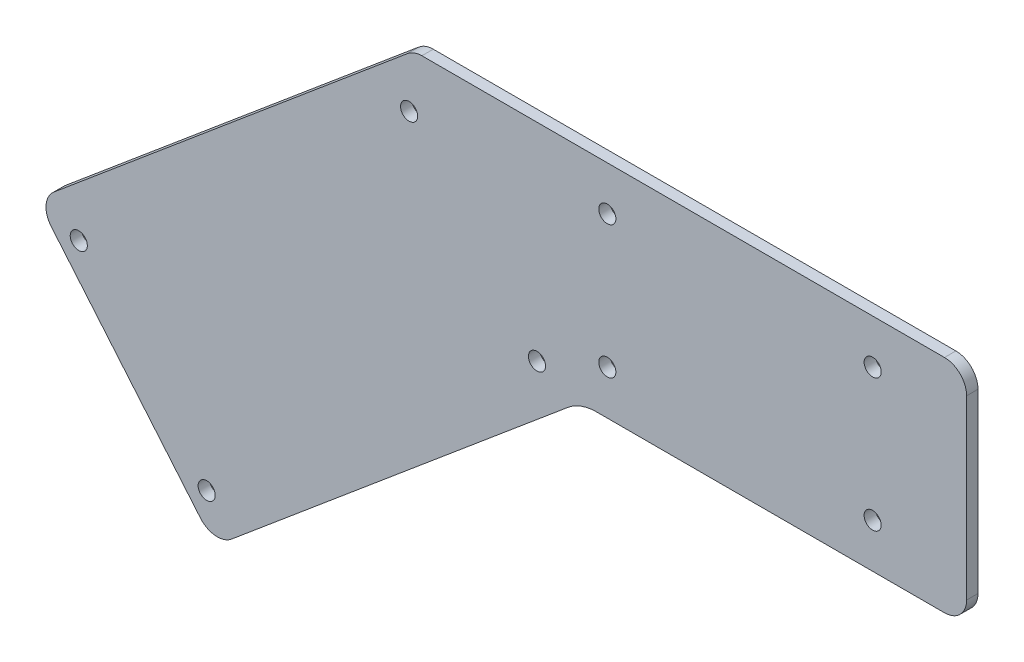
ISO-10303-21;
HEADER;
FILE_DESCRIPTION(('STEP AP214'),'2;1');
FILE_NAME('part.step','',(''),(''),'','','');
FILE_SCHEMA(('AUTOMOTIVE_DESIGN { 1 0 10303 214 1 1 1 1 }'));
ENDSEC;
DATA;
#1=APPLICATION_CONTEXT('core data for automotive mechanical design processes');
#2=APPLICATION_PROTOCOL_DEFINITION('international standard','automotive_design',2000,#1);
#3=PRODUCT_CONTEXT('',#1,'mechanical');
#4=PRODUCT('Part','Part','',(#3));
#5=PRODUCT_RELATED_PRODUCT_CATEGORY('part','',(#4));
#6=PRODUCT_DEFINITION_FORMATION('','',#4);
#7=PRODUCT_DEFINITION_CONTEXT('part definition',#1,'design');
#8=PRODUCT_DEFINITION('design','',#6,#7);
#9=PRODUCT_DEFINITION_SHAPE('','',#8);
#10=(LENGTH_UNIT() NAMED_UNIT(*) SI_UNIT(.MILLI.,.METRE.));
#11=(NAMED_UNIT(*) PLANE_ANGLE_UNIT() SI_UNIT($,.RADIAN.));
#12=(NAMED_UNIT(*) SI_UNIT($,.STERADIAN.) SOLID_ANGLE_UNIT());
#13=UNCERTAINTY_MEASURE_WITH_UNIT(LENGTH_MEASURE(1.E-05),#10,'distance_accuracy_value','');
#14=(GEOMETRIC_REPRESENTATION_CONTEXT(3) GLOBAL_UNCERTAINTY_ASSIGNED_CONTEXT((#13)) GLOBAL_UNIT_ASSIGNED_CONTEXT((#10,
#11,#12)) REPRESENTATION_CONTEXT('',''));
#15=CARTESIAN_POINT('',(0.,0.,0.));
#16=DIRECTION('',(0.,0.,1.));
#17=DIRECTION('',(1.,0.,0.));
#18=AXIS2_PLACEMENT_3D('',#15,#16,#17);
#19=CARTESIAN_POINT('',(0.,0.,0.));
#20=DIRECTION('',(0.,0.,-1.));
#21=DIRECTION('',(-1.,0.,0.));
#22=AXIS2_PLACEMENT_3D('',#19,#20,#21);
#23=PLANE('',#22);
#24=CARTESIAN_POINT('',(-96.225144730726,-63.4988219562365,0.));
#25=DIRECTION('',(0.,0.,1.));
#26=DIRECTION('',(1.,0.,0.));
#27=AXIS2_PLACEMENT_3D('',#24,#25,#26);
#28=CIRCLE('',#27,2.45744999999999);
#29=CARTESIAN_POINT('',(-93.767694730726,-63.4988219562365,0.));
#30=VERTEX_POINT('',#29);
#31=EDGE_CURVE('E351',#30,#30,#28,.T.);
#32=ORIENTED_EDGE('',*,*,#31,.F.);
#33=EDGE_LOOP('',(#32));
#34=FACE_BOUND('',#33,.T.);
#35=CARTESIAN_POINT('',(35.3656203320675,-27.6850861110511,0.));
#36=DIRECTION('',(0.,0.,1.));
#37=DIRECTION('',(1.,0.,0.));
#38=AXIS2_PLACEMENT_3D('',#35,#36,#37);
#39=CIRCLE('',#38,2.45744999999999);
#40=CARTESIAN_POINT('',(37.8230703320674,-27.6850861110511,0.));
#41=VERTEX_POINT('',#40);
#42=EDGE_CURVE('E360',#41,#41,#39,.T.);
#43=ORIENTED_EDGE('',*,*,#42,.F.);
#44=EDGE_LOOP('',(#43));
#45=FACE_BOUND('',#44,.T.);
#46=CARTESIAN_POINT('',(-59.4898328371405,-107.278261880486,0.));
#47=DIRECTION('',(0.,0.,1.));
#48=DIRECTION('',(1.,0.,0.));
#49=AXIS2_PLACEMENT_3D('',#46,#47,#48);
#50=CIRCLE('',#49,2.45744999999999);
#51=CARTESIAN_POINT('',(-57.0323828371405,-107.278261880486,0.));
#52=VERTEX_POINT('',#51);
#53=EDGE_CURVE('E365',#52,#52,#50,.T.);
#54=ORIENTED_EDGE('',*,*,#53,.F.);
#55=EDGE_LOOP('',(#54));
#56=FACE_BOUND('',#55,.T.);
#57=CARTESIAN_POINT('',(55.5625,19.05,0.));
#58=DIRECTION('',(0.,0.,1.));
#59=DIRECTION('',(1.,0.,0.));
#60=AXIS2_PLACEMENT_3D('',#57,#58,#59);
#61=CIRCLE('',#60,2.45744999999999);
#62=CARTESIAN_POINT('',(58.01995,19.05,0.));
#63=VERTEX_POINT('',#62);
#64=EDGE_CURVE('E235',#63,#63,#61,.T.);
#65=ORIENTED_EDGE('',*,*,#64,.F.);
#66=EDGE_LOOP('',(#65));
#67=FACE_BOUND('',#66,.T.);
#68=CARTESIAN_POINT('',(55.5625,-19.05,0.));
#69=DIRECTION('',(0.,0.,1.));
#70=DIRECTION('',(1.,0.,0.));
#71=AXIS2_PLACEMENT_3D('',#68,#69,#70);
#72=CIRCLE('',#71,2.45744999999999);
#73=CARTESIAN_POINT('',(58.01995,-19.05,0.));
#74=VERTEX_POINT('',#73);
#75=EDGE_CURVE('E243',#74,#74,#72,.T.);
#76=ORIENTED_EDGE('',*,*,#75,.F.);
#77=EDGE_LOOP('',(#76));
#78=FACE_BOUND('',#77,.T.);
#79=CARTESIAN_POINT('',(131.7625,19.05,0.));
#80=DIRECTION('',(0.,0.,1.));
#81=DIRECTION('',(1.,0.,0.));
#82=AXIS2_PLACEMENT_3D('',#79,#80,#81);
#83=CIRCLE('',#82,2.45745);
#84=CARTESIAN_POINT('',(134.21995,19.05,0.));
#85=VERTEX_POINT('',#84);
#86=EDGE_CURVE('E249',#85,#85,#83,.T.);
#87=ORIENTED_EDGE('',*,*,#86,.F.);
#88=EDGE_LOOP('',(#87));
#89=FACE_BOUND('',#88,.T.);
#90=DIRECTION('',(0.766044443118982,0.642787609686535,0.));
#91=VECTOR('',#90,1.);
#92=CARTESIAN_POINT('',(47.8092256273129,-31.75,0.));
#93=LINE('',#92,#91);
#94=CARTESIAN_POINT('',(-52.3468555244989,-115.790930754646,0.));
#95=VERTEX_POINT('',#94);
#96=CARTESIAN_POINT('',(44.2682449594746,-34.721235572389,0.));
#97=VERTEX_POINT('',#96);
#98=EDGE_CURVE('E213',#95,#97,#93,.T.);
#99=ORIENTED_EDGE('',*,*,#98,.T.);
#100=CARTESIAN_POINT('',(52.4316476024936,-44.45,0.));
#101=DIRECTION('',(0.,0.,-1.));
#102=DIRECTION('',(-1.,0.,0.));
#103=AXIS2_PLACEMENT_3D('',#100,#101,#102);
#104=CIRCLE('',#103,12.7);
#105=CARTESIAN_POINT('',(52.4316476024936,-31.75,0.));
#106=VERTEX_POINT('',#105);
#107=EDGE_CURVE('E60',#97,#106,#104,.T.);
#108=ORIENTED_EDGE('',*,*,#107,.T.);
#109=DIRECTION('',(1.,0.,0.));
#110=VECTOR('',#109,1.);
#111=CARTESIAN_POINT('',(0.,-31.75,0.));
#112=LINE('',#111,#110);
#113=CARTESIAN_POINT('',(152.4,-31.75,0.));
#114=VERTEX_POINT('',#113);
#115=EDGE_CURVE('E260',#106,#114,#112,.T.);
#116=ORIENTED_EDGE('',*,*,#115,.T.);
#117=CARTESIAN_POINT('',(152.4,-25.4,0.));
#118=DIRECTION('',(0.,0.,-1.));
#119=DIRECTION('',(-1.,0.,0.));
#120=AXIS2_PLACEMENT_3D('',#117,#118,#119);
#121=CIRCLE('',#120,6.35);
#122=CARTESIAN_POINT('',(158.75,-25.4,0.));
#123=VERTEX_POINT('',#122);
#124=EDGE_CURVE('E160',#114,#123,#121,.F.);
#125=ORIENTED_EDGE('',*,*,#124,.T.);
#126=DIRECTION('',(0.,1.,0.));
#127=VECTOR('',#126,1.);
#128=CARTESIAN_POINT('',(158.75,-31.75,0.));
#129=LINE('',#128,#127);
#130=CARTESIAN_POINT('',(158.75,25.4,0.));
#131=VERTEX_POINT('',#130);
#132=EDGE_CURVE('E263',#123,#131,#129,.T.);
#133=ORIENTED_EDGE('',*,*,#132,.T.);
#134=CARTESIAN_POINT('',(152.4,25.4,0.));
#135=DIRECTION('',(0.,0.,-1.));
#136=DIRECTION('',(-1.,0.,0.));
#137=AXIS2_PLACEMENT_3D('',#134,#135,#136);
#138=CIRCLE('',#137,6.35);
#139=CARTESIAN_POINT('',(152.4,31.75,0.));
#140=VERTEX_POINT('',#139);
#141=EDGE_CURVE('E174',#131,#140,#138,.F.);
#142=ORIENTED_EDGE('',*,*,#141,.T.);
#143=DIRECTION('',(-1.,0.,0.));
#144=VECTOR('',#143,1.);
#145=CARTESIAN_POINT('',(0.,31.75,0.));
#146=LINE('',#145,#144);
#147=CARTESIAN_POINT('',(2.31121098759034,31.75,0.));
#148=VERTEX_POINT('',#147);
#149=EDGE_CURVE('E145',#140,#148,#146,.T.);
#150=ORIENTED_EDGE('',*,*,#149,.T.);
#151=CARTESIAN_POINT('',(2.31121098759036,25.4,0.));
#152=DIRECTION('',(0.,0.,-1.));
#153=DIRECTION('',(-1.,0.,0.));
#154=AXIS2_PLACEMENT_3D('',#151,#152,#153);
#155=CIRCLE('',#154,6.35);
#156=CARTESIAN_POINT('',(-1.77049033391914,30.2643822138055,0.));
#157=VERTEX_POINT('',#156);
#158=EDGE_CURVE('E172',#148,#157,#155,.F.);
#159=ORIENTED_EDGE('',*,*,#158,.T.);
#160=DIRECTION('',(-0.766044443118982,-0.642787609686535,0.));
#161=VECTOR('',#160,1.);
#162=CARTESIAN_POINT('',(0.,31.75,0.));
#163=LINE('',#162,#161);
#164=CARTESIAN_POINT('',(-103.368122043368,-54.9861530820768,0.));
#165=VERTEX_POINT('',#164);
#166=EDGE_CURVE('E226',#157,#165,#163,.T.);
#167=ORIENTED_EDGE('',*,*,#166,.T.);
#168=CARTESIAN_POINT('',(-99.2864207218581,-59.8505352958824,0.));
#169=DIRECTION('',(0.,0.,-1.));
#170=DIRECTION('',(-1.,0.,0.));
#171=AXIS2_PLACEMENT_3D('',#168,#169,#170);
#172=CIRCLE('',#171,6.35);
#173=CARTESIAN_POINT('',(-104.150802935664,-63.9322366173919,0.));
#174=VERTEX_POINT('',#173);
#175=EDGE_CURVE('E164',#165,#174,#172,.F.);
#176=ORIENTED_EDGE('',*,*,#175,.T.);
#177=DIRECTION('',(0.642787609686535,-0.766044443118982,0.));
#178=VECTOR('',#177,1.);
#179=CARTESIAN_POINT('',(-57.2112377383044,-119.872632076156,0.));
#180=LINE('',#179,#178);
#181=CARTESIAN_POINT('',(-61.2929390598139,-115.00824986235,0.));
#182=VERTEX_POINT('',#181);
#183=EDGE_CURVE('E221',#174,#182,#180,.T.);
#184=ORIENTED_EDGE('',*,*,#183,.T.);
#185=CARTESIAN_POINT('',(-56.4285568460084,-110.92654854084,0.));
#186=DIRECTION('',(0.,0.,-1.));
#187=DIRECTION('',(-1.,0.,0.));
#188=AXIS2_PLACEMENT_3D('',#185,#186,#187);
#189=CIRCLE('',#188,6.35);
#190=EDGE_CURVE('E161',#182,#95,#189,.F.);
#191=ORIENTED_EDGE('',*,*,#190,.T.);
#192=EDGE_LOOP('',(#99,#108,#116,#125,#133,#142,#150,#159,#167,#176,#184,#191));
#193=FACE_BOUND('',#192,.T.);
#194=CARTESIAN_POINT('',(131.7625,-19.05,0.));
#195=DIRECTION('',(0.,0.,1.));
#196=DIRECTION('',(1.,0.,0.));
#197=AXIS2_PLACEMENT_3D('',#194,#195,#196);
#198=CIRCLE('',#197,2.45745);
#199=CARTESIAN_POINT('',(134.21995,-19.05,0.));
#200=VERTEX_POINT('',#199);
#201=EDGE_CURVE('E255',#200,#200,#198,.T.);
#202=ORIENTED_EDGE('',*,*,#201,.F.);
#203=EDGE_LOOP('',(#202));
#204=FACE_BOUND('',#203,.T.);
#205=CARTESIAN_POINT('',(-1.36969156151808,16.0943538131988,0.));
#206=DIRECTION('',(0.,0.,1.));
#207=DIRECTION('',(1.,0.,0.));
#208=AXIS2_PLACEMENT_3D('',#205,#206,#207);
#209=CIRCLE('',#208,2.45744999999999);
#210=CARTESIAN_POINT('',(1.08775843848191,16.0943538131988,0.));
#211=VERTEX_POINT('',#210);
#212=EDGE_CURVE('E347',#211,#211,#209,.T.);
#213=ORIENTED_EDGE('',*,*,#212,.F.);
#214=EDGE_LOOP('',(#213));
#215=FACE_BOUND('',#214,.T.);
#216=ADVANCED_FACE('F52',(#34,#45,#56,#67,#78,#89,#193,#204,#215),#23,.F.);
#217=CARTESIAN_POINT('',(0.,31.75,-3.26389999999996));
#218=DIRECTION('',(0.,1.,0.));
#219=DIRECTION('',(0.,0.,1.));
#220=AXIS2_PLACEMENT_3D('',#217,#218,#219);
#221=PLANE('',#220);
#222=ORIENTED_EDGE('',*,*,#149,.F.);
#223=DIRECTION('',(0.,0.,1.));
#224=VECTOR('',#223,1.);
#225=CARTESIAN_POINT('',(152.4,31.75,-3.26390000000001));
#226=LINE('',#225,#224);
#227=CARTESIAN_POINT('',(152.4,31.75,-3.26390000000001));
#228=VERTEX_POINT('',#227);
#229=EDGE_CURVE('E191',#140,#228,#226,.F.);
#230=ORIENTED_EDGE('',*,*,#229,.T.);
#231=DIRECTION('',(-1.,0.,0.));
#232=VECTOR('',#231,1.);
#233=CARTESIAN_POINT('',(0.,31.75,-3.26389999999996));
#234=LINE('',#233,#232);
#235=CARTESIAN_POINT('',(2.31121098759034,31.75,-3.26389999999996));
#236=VERTEX_POINT('',#235);
#237=EDGE_CURVE('E162',#228,#236,#234,.T.);
#238=ORIENTED_EDGE('',*,*,#237,.T.);
#239=DIRECTION('',(0.,0.,1.));
#240=VECTOR('',#239,1.);
#241=CARTESIAN_POINT('',(2.31121098759034,31.75,-3.26389999999996));
#242=LINE('',#241,#240);
#243=EDGE_CURVE('E155',#236,#148,#242,.T.);
#244=ORIENTED_EDGE('',*,*,#243,.T.);
#245=EDGE_LOOP('',(#222,#230,#238,#244));
#246=FACE_BOUND('',#245,.T.);
#247=ADVANCED_FACE('F271',(#246),#221,.T.);
#248=CARTESIAN_POINT('',(158.75,-31.75,-3.26389999999999));
#249=DIRECTION('',(1.,0.,0.));
#250=DIRECTION('',(0.,0.,-1.));
#251=AXIS2_PLACEMENT_3D('',#248,#249,#250);
#252=PLANE('',#251);
#253=ORIENTED_EDGE('',*,*,#132,.F.);
#254=DIRECTION('',(0.,0.,1.));
#255=VECTOR('',#254,1.);
#256=CARTESIAN_POINT('',(158.75,-25.4,-3.26389999999999));
#257=LINE('',#256,#255);
#258=CARTESIAN_POINT('',(158.75,-25.4,-3.26389999999999));
#259=VERTEX_POINT('',#258);
#260=EDGE_CURVE('E180',#123,#259,#257,.F.);
#261=ORIENTED_EDGE('',*,*,#260,.T.);
#262=DIRECTION('',(0.,1.,0.));
#263=VECTOR('',#262,1.);
#264=CARTESIAN_POINT('',(158.75,-31.75,-3.26389999999999));
#265=LINE('',#264,#263);
#266=CARTESIAN_POINT('',(158.75,25.4,-3.26390000000004));
#267=VERTEX_POINT('',#266);
#268=EDGE_CURVE('E144',#259,#267,#265,.T.);
#269=ORIENTED_EDGE('',*,*,#268,.T.);
#270=DIRECTION('',(0.,0.,1.));
#271=VECTOR('',#270,1.);
#272=CARTESIAN_POINT('',(158.75,25.4,-3.26390000000004));
#273=LINE('',#272,#271);
#274=EDGE_CURVE('E177',#267,#131,#273,.T.);
#275=ORIENTED_EDGE('',*,*,#274,.T.);
#276=EDGE_LOOP('',(#253,#261,#269,#275));
#277=FACE_BOUND('',#276,.T.);
#278=ADVANCED_FACE('F279',(#277),#252,.T.);
#279=CARTESIAN_POINT('',(0.,-31.75,-3.26390000000004));
#280=DIRECTION('',(0.,-1.,0.));
#281=DIRECTION('',(0.,0.,-1.));
#282=AXIS2_PLACEMENT_3D('',#279,#280,#281);
#283=PLANE('',#282);
#284=ORIENTED_EDGE('',*,*,#115,.F.);
#285=DIRECTION('',(0.,0.,1.));
#286=VECTOR('',#285,1.);
#287=CARTESIAN_POINT('',(52.4316476024936,-31.75,-3.26389999999999));
#288=LINE('',#287,#286);
#289=CARTESIAN_POINT('',(52.4316476024936,-31.75,-3.26390000000001));
#290=VERTEX_POINT('',#289);
#291=EDGE_CURVE('E73',#106,#290,#288,.F.);
#292=ORIENTED_EDGE('',*,*,#291,.T.);
#293=DIRECTION('',(1.,0.,0.));
#294=VECTOR('',#293,1.);
#295=CARTESIAN_POINT('',(0.,-31.75,-3.26390000000004));
#296=LINE('',#295,#294);
#297=CARTESIAN_POINT('',(152.4,-31.75,-3.26390000000001));
#298=VERTEX_POINT('',#297);
#299=EDGE_CURVE('E137',#290,#298,#296,.T.);
#300=ORIENTED_EDGE('',*,*,#299,.T.);
#301=DIRECTION('',(0.,0.,1.));
#302=VECTOR('',#301,1.);
#303=CARTESIAN_POINT('',(152.4,-31.75,-3.26390000000001));
#304=LINE('',#303,#302);
#305=EDGE_CURVE('E141',#298,#114,#304,.T.);
#306=ORIENTED_EDGE('',*,*,#305,.T.);
#307=EDGE_LOOP('',(#284,#292,#300,#306));
#308=FACE_BOUND('',#307,.T.);
#309=ADVANCED_FACE('F139',(#308),#283,.T.);
#310=CARTESIAN_POINT('',(0.,0.,-3.26389999999999));
#311=DIRECTION('',(0.,0.,-1.));
#312=DIRECTION('',(-1.,0.,0.));
#313=AXIS2_PLACEMENT_3D('',#310,#311,#312);
#314=PLANE('',#313);
#315=CARTESIAN_POINT('',(-1.36969156151808,16.0943538131988,-3.26389999999999));
#316=DIRECTION('',(0.,0.,-1.));
#317=DIRECTION('',(-1.,0.,0.));
#318=AXIS2_PLACEMENT_3D('',#315,#316,#317);
#319=CIRCLE('',#318,2.45744999999999);
#320=CARTESIAN_POINT('',(-3.82714156151808,16.0943538131988,-3.26389999999999));
#321=VERTEX_POINT('',#320);
#322=EDGE_CURVE('E350',#321,#321,#319,.T.);
#323=ORIENTED_EDGE('',*,*,#322,.F.);
#324=EDGE_LOOP('',(#323));
#325=FACE_BOUND('',#324,.T.);
#326=CARTESIAN_POINT('',(-96.225144730726,-63.4988219562365,-3.26390000000001));
#327=DIRECTION('',(0.,0.,-1.));
#328=DIRECTION('',(-1.,0.,0.));
#329=AXIS2_PLACEMENT_3D('',#326,#327,#328);
#330=CIRCLE('',#329,2.45744999999999);
#331=CARTESIAN_POINT('',(-98.682594730726,-63.4988219562365,-3.26390000000001));
#332=VERTEX_POINT('',#331);
#333=EDGE_CURVE('E354',#332,#332,#330,.T.);
#334=ORIENTED_EDGE('',*,*,#333,.F.);
#335=EDGE_LOOP('',(#334));
#336=FACE_BOUND('',#335,.T.);
#337=CARTESIAN_POINT('',(35.3656203320674,-27.6850861110512,-3.26389999999999));
#338=DIRECTION('',(0.,0.,-1.));
#339=DIRECTION('',(-1.,0.,0.));
#340=AXIS2_PLACEMENT_3D('',#337,#338,#339);
#341=CIRCLE('',#340,2.45744999999999);
#342=CARTESIAN_POINT('',(32.9081703320674,-27.6850861110512,-3.26389999999999));
#343=VERTEX_POINT('',#342);
#344=EDGE_CURVE('E363',#343,#343,#341,.T.);
#345=ORIENTED_EDGE('',*,*,#344,.F.);
#346=EDGE_LOOP('',(#345));
#347=FACE_BOUND('',#346,.T.);
#348=CARTESIAN_POINT('',(-59.4898328371404,-107.278261880486,-3.26389999999999));
#349=DIRECTION('',(0.,0.,-1.));
#350=DIRECTION('',(-1.,0.,0.));
#351=AXIS2_PLACEMENT_3D('',#348,#349,#350);
#352=CIRCLE('',#351,2.45744999999999);
#353=CARTESIAN_POINT('',(-61.9472828371404,-107.278261880486,-3.26389999999999));
#354=VERTEX_POINT('',#353);
#355=EDGE_CURVE('E229',#354,#354,#352,.T.);
#356=ORIENTED_EDGE('',*,*,#355,.F.);
#357=EDGE_LOOP('',(#356));
#358=FACE_BOUND('',#357,.T.);
#359=ORIENTED_EDGE('',*,*,#268,.F.);
#360=CARTESIAN_POINT('',(152.4,-25.4,-3.26389999999999));
#361=DIRECTION('',(0.,0.,-1.));
#362=DIRECTION('',(-1.,0.,0.));
#363=AXIS2_PLACEMENT_3D('',#360,#361,#362);
#364=CIRCLE('',#363,6.35);
#365=EDGE_CURVE('E149',#259,#298,#364,.T.);
#366=ORIENTED_EDGE('',*,*,#365,.T.);
#367=ORIENTED_EDGE('',*,*,#299,.F.);
#368=CARTESIAN_POINT('',(52.4316476024936,-44.45,-3.26390000000001));
#369=DIRECTION('',(0.,0.,-1.));
#370=DIRECTION('',(-1.,0.,0.));
#371=AXIS2_PLACEMENT_3D('',#368,#369,#370);
#372=CIRCLE('',#371,12.7);
#373=CARTESIAN_POINT('',(44.2682449594746,-34.721235572389,-3.26389999999999));
#374=VERTEX_POINT('',#373);
#375=EDGE_CURVE('E13',#290,#374,#372,.F.);
#376=ORIENTED_EDGE('',*,*,#375,.T.);
#377=DIRECTION('',(0.766044443118982,0.642787609686535,0.));
#378=VECTOR('',#377,1.);
#379=CARTESIAN_POINT('',(47.8092256273129,-31.75,-3.26389999999999));
#380=LINE('',#379,#378);
#381=CARTESIAN_POINT('',(-52.3468555244989,-115.790930754646,-3.26390000000001));
#382=VERTEX_POINT('',#381);
#383=EDGE_CURVE('E216',#382,#374,#380,.T.);
#384=ORIENTED_EDGE('',*,*,#383,.F.);
#385=CARTESIAN_POINT('',(-56.4285568460084,-110.92654854084,-3.26389999999999));
#386=DIRECTION('',(0.,0.,-1.));
#387=DIRECTION('',(-1.,0.,0.));
#388=AXIS2_PLACEMENT_3D('',#385,#386,#387);
#389=CIRCLE('',#388,6.35);
#390=CARTESIAN_POINT('',(-61.2929390598139,-115.00824986235,-3.26389999999999));
#391=VERTEX_POINT('',#390);
#392=EDGE_CURVE('E182',#382,#391,#389,.T.);
#393=ORIENTED_EDGE('',*,*,#392,.T.);
#394=DIRECTION('',(0.642787609686535,-0.766044443118982,0.));
#395=VECTOR('',#394,1.);
#396=CARTESIAN_POINT('',(-57.2112377383044,-119.872632076156,-3.26389999999999));
#397=LINE('',#396,#395);
#398=CARTESIAN_POINT('',(-104.150802935664,-63.9322366173918,-3.26389999999999));
#399=VERTEX_POINT('',#398);
#400=EDGE_CURVE('E224',#399,#391,#397,.T.);
#401=ORIENTED_EDGE('',*,*,#400,.F.);
#402=CARTESIAN_POINT('',(-99.2864207218581,-59.8505352958824,-3.26389999999999));
#403=DIRECTION('',(0.,0.,-1.));
#404=DIRECTION('',(-1.,0.,0.));
#405=AXIS2_PLACEMENT_3D('',#402,#403,#404);
#406=CIRCLE('',#405,6.35);
#407=CARTESIAN_POINT('',(-103.368122043368,-54.9861530820768,-3.26389999999999));
#408=VERTEX_POINT('',#407);
#409=EDGE_CURVE('E184',#399,#408,#406,.T.);
#410=ORIENTED_EDGE('',*,*,#409,.T.);
#411=DIRECTION('',(-0.766044443118982,-0.642787609686535,0.));
#412=VECTOR('',#411,1.);
#413=CARTESIAN_POINT('',(0.,31.75,-3.26389999999996));
#414=LINE('',#413,#412);
#415=CARTESIAN_POINT('',(-1.77049033391915,30.2643822138056,-3.26389999999996));
#416=VERTEX_POINT('',#415);
#417=EDGE_CURVE('E220',#416,#408,#414,.T.);
#418=ORIENTED_EDGE('',*,*,#417,.F.);
#419=CARTESIAN_POINT('',(2.31121098759034,25.4,-3.26389999999996));
#420=DIRECTION('',(0.,0.,-1.));
#421=DIRECTION('',(-1.,0.,0.));
#422=AXIS2_PLACEMENT_3D('',#419,#420,#421);
#423=CIRCLE('',#422,6.35);
#424=EDGE_CURVE('E186',#416,#236,#423,.T.);
#425=ORIENTED_EDGE('',*,*,#424,.T.);
#426=ORIENTED_EDGE('',*,*,#237,.F.);
#427=CARTESIAN_POINT('',(152.4,25.4,-3.26390000000001));
#428=DIRECTION('',(0.,0.,-1.));
#429=DIRECTION('',(-1.,0.,0.));
#430=AXIS2_PLACEMENT_3D('',#427,#428,#429);
#431=CIRCLE('',#430,6.35);
#432=EDGE_CURVE('E156',#228,#267,#431,.T.);
#433=ORIENTED_EDGE('',*,*,#432,.T.);
#434=EDGE_LOOP('',(#359,#366,#367,#376,#384,#393,#401,#410,#418,#425,#426,#433));
#435=FACE_BOUND('',#434,.T.);
#436=CARTESIAN_POINT('',(55.5625,19.05,-3.26389999999999));
#437=DIRECTION('',(0.,0.,-1.));
#438=DIRECTION('',(-1.,0.,0.));
#439=AXIS2_PLACEMENT_3D('',#436,#437,#438);
#440=CIRCLE('',#439,2.45744999999999);
#441=CARTESIAN_POINT('',(53.10505,19.05,-3.26389999999999));
#442=VERTEX_POINT('',#441);
#443=EDGE_CURVE('E240',#442,#442,#440,.T.);
#444=ORIENTED_EDGE('',*,*,#443,.F.);
#445=EDGE_LOOP('',(#444));
#446=FACE_BOUND('',#445,.T.);
#447=CARTESIAN_POINT('',(55.5625,-19.05,-3.26390000000001));
#448=DIRECTION('',(0.,0.,-1.));
#449=DIRECTION('',(-1.,0.,0.));
#450=AXIS2_PLACEMENT_3D('',#447,#448,#449);
#451=CIRCLE('',#450,2.45744999999999);
#452=CARTESIAN_POINT('',(53.10505,-19.05,-3.26390000000001));
#453=VERTEX_POINT('',#452);
#454=EDGE_CURVE('E246',#453,#453,#451,.T.);
#455=ORIENTED_EDGE('',*,*,#454,.F.);
#456=EDGE_LOOP('',(#455));
#457=FACE_BOUND('',#456,.T.);
#458=CARTESIAN_POINT('',(131.7625,19.05,-3.26390000000004));
#459=DIRECTION('',(0.,0.,-1.));
#460=DIRECTION('',(-1.,0.,0.));
#461=AXIS2_PLACEMENT_3D('',#458,#459,#460);
#462=CIRCLE('',#461,2.45745);
#463=CARTESIAN_POINT('',(129.30505,19.05,-3.26390000000004));
#464=VERTEX_POINT('',#463);
#465=EDGE_CURVE('E252',#464,#464,#462,.T.);
#466=ORIENTED_EDGE('',*,*,#465,.F.);
#467=EDGE_LOOP('',(#466));
#468=FACE_BOUND('',#467,.T.);
#469=CARTESIAN_POINT('',(131.7625,-19.05,-3.26390000000001));
#470=DIRECTION('',(0.,0.,-1.));
#471=DIRECTION('',(-1.,0.,0.));
#472=AXIS2_PLACEMENT_3D('',#469,#470,#471);
#473=CIRCLE('',#472,2.45745);
#474=CARTESIAN_POINT('',(129.30505,-19.05,-3.26390000000001));
#475=VERTEX_POINT('',#474);
#476=EDGE_CURVE('E258',#475,#475,#473,.T.);
#477=ORIENTED_EDGE('',*,*,#476,.F.);
#478=EDGE_LOOP('',(#477));
#479=FACE_BOUND('',#478,.T.);
#480=ADVANCED_FACE('F150',(#325,#336,#347,#358,#435,#446,#457,#468,#479),#314,.T.);
#481=CARTESIAN_POINT('',(131.7625,-19.05,0.));
#482=DIRECTION('',(0.,0.,1.));
#483=DIRECTION('',(1.,0.,0.));
#484=AXIS2_PLACEMENT_3D('',#481,#482,#483);
#485=CYLINDRICAL_SURFACE('',#484,2.45745);
#486=ORIENTED_EDGE('',*,*,#201,.T.);
#487=EDGE_LOOP('',(#486));
#488=FACE_BOUND('',#487,.T.);
#489=ORIENTED_EDGE('',*,*,#476,.T.);
#490=EDGE_LOOP('',(#489));
#491=FACE_BOUND('',#490,.T.);
#492=ADVANCED_FACE('F298',(#488,#491),#485,.F.);
#493=CARTESIAN_POINT('',(131.7625,19.05,0.));
#494=DIRECTION('',(0.,0.,1.));
#495=DIRECTION('',(1.,0.,0.));
#496=AXIS2_PLACEMENT_3D('',#493,#494,#495);
#497=CYLINDRICAL_SURFACE('',#496,2.45745);
#498=ORIENTED_EDGE('',*,*,#86,.T.);
#499=EDGE_LOOP('',(#498));
#500=FACE_BOUND('',#499,.T.);
#501=ORIENTED_EDGE('',*,*,#465,.T.);
#502=EDGE_LOOP('',(#501));
#503=FACE_BOUND('',#502,.T.);
#504=ADVANCED_FACE('F302',(#500,#503),#497,.F.);
#505=CARTESIAN_POINT('',(55.5625,-19.05,0.));
#506=DIRECTION('',(0.,0.,1.));
#507=DIRECTION('',(1.,0.,0.));
#508=AXIS2_PLACEMENT_3D('',#505,#506,#507);
#509=CYLINDRICAL_SURFACE('',#508,2.45744999999999);
#510=ORIENTED_EDGE('',*,*,#75,.T.);
#511=EDGE_LOOP('',(#510));
#512=FACE_BOUND('',#511,.T.);
#513=ORIENTED_EDGE('',*,*,#454,.T.);
#514=EDGE_LOOP('',(#513));
#515=FACE_BOUND('',#514,.T.);
#516=ADVANCED_FACE('F306',(#512,#515),#509,.F.);
#517=CARTESIAN_POINT('',(55.5625,19.05,0.));
#518=DIRECTION('',(0.,0.,1.));
#519=DIRECTION('',(1.,0.,0.));
#520=AXIS2_PLACEMENT_3D('',#517,#518,#519);
#521=CYLINDRICAL_SURFACE('',#520,2.45744999999999);
#522=ORIENTED_EDGE('',*,*,#64,.T.);
#523=EDGE_LOOP('',(#522));
#524=FACE_BOUND('',#523,.T.);
#525=ORIENTED_EDGE('',*,*,#443,.T.);
#526=EDGE_LOOP('',(#525));
#527=FACE_BOUND('',#526,.T.);
#528=ADVANCED_FACE('F310',(#524,#527),#521,.F.);
#529=CARTESIAN_POINT('',(0.,31.75,-220.837896661008));
#530=DIRECTION('',(-0.642787609686535,0.766044443118982,0.));
#531=DIRECTION('',(-0.766044443118982,-0.642787609686535,0.));
#532=AXIS2_PLACEMENT_3D('',#529,#530,#531);
#533=PLANE('',#532);
#534=ORIENTED_EDGE('',*,*,#166,.F.);
#535=DIRECTION('',(0.,0.,1.));
#536=VECTOR('',#535,1.);
#537=CARTESIAN_POINT('',(-1.77049033391914,30.2643822138056,-220.837896661008));
#538=LINE('',#537,#536);
#539=EDGE_CURVE('E196',#157,#416,#538,.F.);
#540=ORIENTED_EDGE('',*,*,#539,.T.);
#541=ORIENTED_EDGE('',*,*,#417,.T.);
#542=DIRECTION('',(0.,0.,1.));
#543=VECTOR('',#542,1.);
#544=CARTESIAN_POINT('',(-103.368122043368,-54.9861530820768,-220.837896661007));
#545=LINE('',#544,#543);
#546=EDGE_CURVE('E193',#408,#165,#545,.T.);
#547=ORIENTED_EDGE('',*,*,#546,.T.);
#548=EDGE_LOOP('',(#534,#540,#541,#547));
#549=FACE_BOUND('',#548,.T.);
#550=ADVANCED_FACE('F314',(#549),#533,.T.);
#551=CARTESIAN_POINT('',(-57.2112377383044,-119.872632076156,-220.837896661008));
#552=DIRECTION('',(-0.766044443118982,-0.642787609686535,0.));
#553=DIRECTION('',(0.642787609686535,-0.766044443118982,0.));
#554=AXIS2_PLACEMENT_3D('',#551,#552,#553);
#555=PLANE('',#554);
#556=ORIENTED_EDGE('',*,*,#183,.F.);
#557=DIRECTION('',(0.,0.,1.));
#558=VECTOR('',#557,1.);
#559=CARTESIAN_POINT('',(-104.150802935664,-63.9322366173919,-220.837896661008));
#560=LINE('',#559,#558);
#561=EDGE_CURVE('E201',#174,#399,#560,.F.);
#562=ORIENTED_EDGE('',*,*,#561,.T.);
#563=ORIENTED_EDGE('',*,*,#400,.T.);
#564=DIRECTION('',(0.,0.,1.));
#565=VECTOR('',#564,1.);
#566=CARTESIAN_POINT('',(-61.2929390598139,-115.00824986235,-220.837896661008));
#567=LINE('',#566,#565);
#568=EDGE_CURVE('E198',#391,#182,#567,.T.);
#569=ORIENTED_EDGE('',*,*,#568,.T.);
#570=EDGE_LOOP('',(#556,#562,#563,#569));
#571=FACE_BOUND('',#570,.T.);
#572=ADVANCED_FACE('F318',(#571),#555,.T.);
#573=CARTESIAN_POINT('',(47.8092256273129,-31.75,-220.837896661008));
#574=DIRECTION('',(0.642787609686535,-0.766044443118982,0.));
#575=DIRECTION('',(0.766044443118982,0.642787609686535,0.));
#576=AXIS2_PLACEMENT_3D('',#573,#574,#575);
#577=PLANE('',#576);
#578=ORIENTED_EDGE('',*,*,#383,.T.);
#579=DIRECTION('',(0.,0.,1.));
#580=VECTOR('',#579,1.);
#581=CARTESIAN_POINT('',(44.2682449594746,-34.721235572389,0.));
#582=LINE('',#581,#580);
#583=EDGE_CURVE('E205',#374,#97,#582,.T.);
#584=ORIENTED_EDGE('',*,*,#583,.T.);
#585=ORIENTED_EDGE('',*,*,#98,.F.);
#586=DIRECTION('',(0.,0.,1.));
#587=VECTOR('',#586,1.);
#588=CARTESIAN_POINT('',(-52.3468555244989,-115.790930754646,-220.837896661008));
#589=LINE('',#588,#587);
#590=EDGE_CURVE('E203',#95,#382,#589,.F.);
#591=ORIENTED_EDGE('',*,*,#590,.T.);
#592=EDGE_LOOP('',(#578,#584,#585,#591));
#593=FACE_BOUND('',#592,.T.);
#594=ADVANCED_FACE('F212',(#593),#577,.T.);
#595=CARTESIAN_POINT('',(-59.4898328371405,-107.278261880486,0.));
#596=DIRECTION('',(0.,0.,1.));
#597=DIRECTION('',(1.,0.,0.));
#598=AXIS2_PLACEMENT_3D('',#595,#596,#597);
#599=CYLINDRICAL_SURFACE('',#598,2.45744999999999);
#600=ORIENTED_EDGE('',*,*,#53,.T.);
#601=EDGE_LOOP('',(#600));
#602=FACE_BOUND('',#601,.T.);
#603=ORIENTED_EDGE('',*,*,#355,.T.);
#604=EDGE_LOOP('',(#603));
#605=FACE_BOUND('',#604,.T.);
#606=ADVANCED_FACE('F325',(#602,#605),#599,.F.);
#607=CARTESIAN_POINT('',(35.3656203320675,-27.6850861110511,0.));
#608=DIRECTION('',(0.,0.,1.));
#609=DIRECTION('',(1.,0.,0.));
#610=AXIS2_PLACEMENT_3D('',#607,#608,#609);
#611=CYLINDRICAL_SURFACE('',#610,2.45744999999999);
#612=ORIENTED_EDGE('',*,*,#42,.T.);
#613=EDGE_LOOP('',(#612));
#614=FACE_BOUND('',#613,.T.);
#615=ORIENTED_EDGE('',*,*,#344,.T.);
#616=EDGE_LOOP('',(#615));
#617=FACE_BOUND('',#616,.T.);
#618=ADVANCED_FACE('F328',(#614,#617),#611,.F.);
#619=CARTESIAN_POINT('',(-96.225144730726,-63.4988219562365,0.));
#620=DIRECTION('',(0.,0.,1.));
#621=DIRECTION('',(1.,0.,0.));
#622=AXIS2_PLACEMENT_3D('',#619,#620,#621);
#623=CYLINDRICAL_SURFACE('',#622,2.45744999999999);
#624=ORIENTED_EDGE('',*,*,#31,.T.);
#625=EDGE_LOOP('',(#624));
#626=FACE_BOUND('',#625,.T.);
#627=ORIENTED_EDGE('',*,*,#333,.T.);
#628=EDGE_LOOP('',(#627));
#629=FACE_BOUND('',#628,.T.);
#630=ADVANCED_FACE('F332',(#626,#629),#623,.F.);
#631=CARTESIAN_POINT('',(-1.36969156151808,16.0943538131988,0.));
#632=DIRECTION('',(0.,0.,1.));
#633=DIRECTION('',(1.,0.,0.));
#634=AXIS2_PLACEMENT_3D('',#631,#632,#633);
#635=CYLINDRICAL_SURFACE('',#634,2.45744999999999);
#636=ORIENTED_EDGE('',*,*,#212,.T.);
#637=EDGE_LOOP('',(#636));
#638=FACE_BOUND('',#637,.T.);
#639=ORIENTED_EDGE('',*,*,#322,.T.);
#640=EDGE_LOOP('',(#639));
#641=FACE_BOUND('',#640,.T.);
#642=ADVANCED_FACE('F336',(#638,#641),#635,.F.);
#643=CARTESIAN_POINT('',(152.4,-25.4,-3.26389999999999));
#644=DIRECTION('',(0.,0.,1.));
#645=DIRECTION('',(1.,0.,0.));
#646=AXIS2_PLACEMENT_3D('',#643,#644,#645);
#647=CYLINDRICAL_SURFACE('',#646,6.35);
#648=ORIENTED_EDGE('',*,*,#365,.F.);
#649=ORIENTED_EDGE('',*,*,#260,.F.);
#650=ORIENTED_EDGE('',*,*,#124,.F.);
#651=ORIENTED_EDGE('',*,*,#305,.F.);
#652=EDGE_LOOP('',(#648,#649,#650,#651));
#653=FACE_BOUND('',#652,.T.);
#654=ADVANCED_FACE('F159',(#653),#647,.T.);
#655=CARTESIAN_POINT('',(152.4,25.4,-3.26390000000001));
#656=DIRECTION('',(0.,0.,1.));
#657=DIRECTION('',(1.,0.,0.));
#658=AXIS2_PLACEMENT_3D('',#655,#656,#657);
#659=CYLINDRICAL_SURFACE('',#658,6.35);
#660=ORIENTED_EDGE('',*,*,#432,.F.);
#661=ORIENTED_EDGE('',*,*,#229,.F.);
#662=ORIENTED_EDGE('',*,*,#141,.F.);
#663=ORIENTED_EDGE('',*,*,#274,.F.);
#664=EDGE_LOOP('',(#660,#661,#662,#663));
#665=FACE_BOUND('',#664,.T.);
#666=ADVANCED_FACE('F276',(#665),#659,.T.);
#667=CARTESIAN_POINT('',(2.31121098759034,25.4,-3.26389999999996));
#668=DIRECTION('',(0.,0.,1.));
#669=DIRECTION('',(1.,0.,0.));
#670=AXIS2_PLACEMENT_3D('',#667,#668,#669);
#671=CYLINDRICAL_SURFACE('',#670,6.35);
#672=ORIENTED_EDGE('',*,*,#424,.F.);
#673=ORIENTED_EDGE('',*,*,#539,.F.);
#674=ORIENTED_EDGE('',*,*,#158,.F.);
#675=ORIENTED_EDGE('',*,*,#243,.F.);
#676=EDGE_LOOP('',(#672,#673,#674,#675));
#677=FACE_BOUND('',#676,.T.);
#678=ADVANCED_FACE('F401',(#677),#671,.T.);
#679=CARTESIAN_POINT('',(-99.2864207218581,-59.8505352958824,-220.837896661007));
#680=DIRECTION('',(0.,0.,1.));
#681=DIRECTION('',(1.,0.,0.));
#682=AXIS2_PLACEMENT_3D('',#679,#680,#681);
#683=CYLINDRICAL_SURFACE('',#682,6.35);
#684=ORIENTED_EDGE('',*,*,#409,.F.);
#685=ORIENTED_EDGE('',*,*,#561,.F.);
#686=ORIENTED_EDGE('',*,*,#175,.F.);
#687=ORIENTED_EDGE('',*,*,#546,.F.);
#688=EDGE_LOOP('',(#684,#685,#686,#687));
#689=FACE_BOUND('',#688,.T.);
#690=ADVANCED_FACE('F406',(#689),#683,.T.);
#691=CARTESIAN_POINT('',(-56.4285568460084,-110.92654854084,-220.837896661008));
#692=DIRECTION('',(0.,0.,1.));
#693=DIRECTION('',(1.,0.,0.));
#694=AXIS2_PLACEMENT_3D('',#691,#692,#693);
#695=CYLINDRICAL_SURFACE('',#694,6.35);
#696=ORIENTED_EDGE('',*,*,#392,.F.);
#697=ORIENTED_EDGE('',*,*,#590,.F.);
#698=ORIENTED_EDGE('',*,*,#190,.F.);
#699=ORIENTED_EDGE('',*,*,#568,.F.);
#700=EDGE_LOOP('',(#696,#697,#698,#699));
#701=FACE_BOUND('',#700,.T.);
#702=ADVANCED_FACE('F409',(#701),#695,.T.);
#703=CARTESIAN_POINT('',(52.4316476024936,-44.45,-220.837896661008));
#704=DIRECTION('',(0.,0.,-1.));
#705=DIRECTION('',(-1.,0.,0.));
#706=AXIS2_PLACEMENT_3D('',#703,#704,#705);
#707=CYLINDRICAL_SURFACE('',#706,12.7);
#708=ORIENTED_EDGE('',*,*,#375,.F.);
#709=ORIENTED_EDGE('',*,*,#291,.F.);
#710=ORIENTED_EDGE('',*,*,#107,.F.);
#711=ORIENTED_EDGE('',*,*,#583,.F.);
#712=EDGE_LOOP('',(#708,#709,#710,#711));
#713=FACE_BOUND('',#712,.T.);
#714=ADVANCED_FACE('F54',(#713),#707,.F.);
#715=CLOSED_SHELL('',(#216,#247,#278,#309,#480,#492,#504,#516,#528,#550,#572,#594,#606,#618,
#630,#642,#654,#666,#678,#690,#702,#714));
#716=MANIFOLD_SOLID_BREP('B2',#715);
#717=ADVANCED_BREP_SHAPE_REPRESENTATION('',(#18,#716),#14);
#718=SHAPE_DEFINITION_REPRESENTATION(#9,#717);
ENDSEC;
END-ISO-10303-21;
